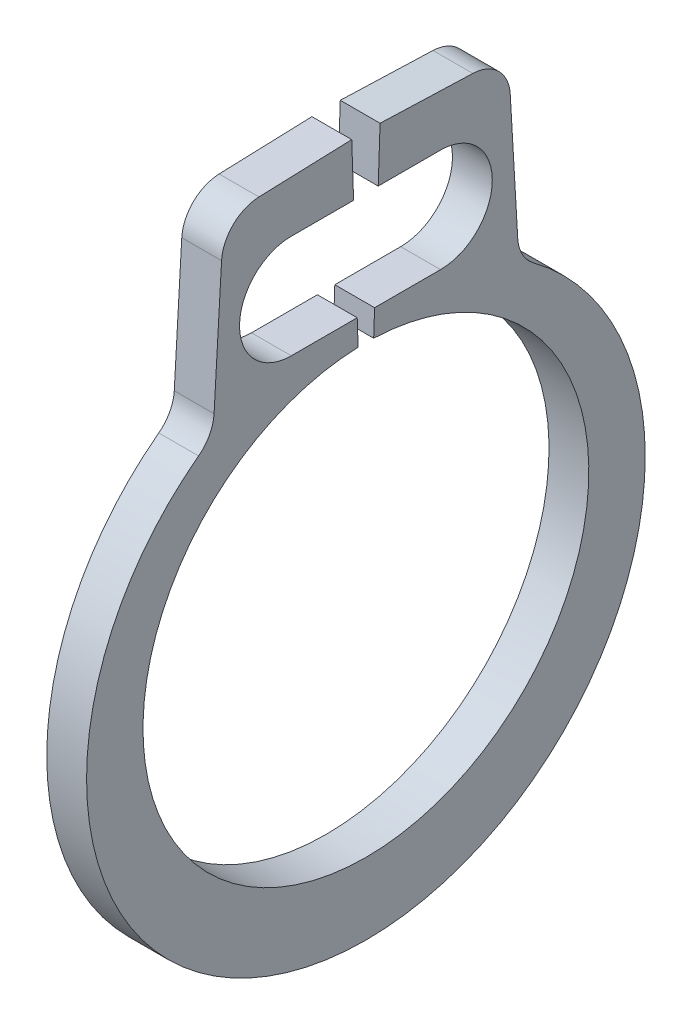
ISO-10303-21;
HEADER;
FILE_DESCRIPTION(('STEP AP214'),'2;1');
FILE_NAME('part.step','',(''),(''),'','','');
FILE_SCHEMA(('AUTOMOTIVE_DESIGN { 1 0 10303 214 1 1 1 1 }'));
ENDSEC;
DATA;
#1=APPLICATION_CONTEXT('core data for automotive mechanical design processes');
#2=APPLICATION_PROTOCOL_DEFINITION('international standard','automotive_design',2000,#1);
#3=PRODUCT_CONTEXT('',#1,'mechanical');
#4=PRODUCT('Part','Part','',(#3));
#5=PRODUCT_RELATED_PRODUCT_CATEGORY('part','',(#4));
#6=PRODUCT_DEFINITION_FORMATION('','',#4);
#7=PRODUCT_DEFINITION_CONTEXT('part definition',#1,'design');
#8=PRODUCT_DEFINITION('design','',#6,#7);
#9=PRODUCT_DEFINITION_SHAPE('','',#8);
#10=(LENGTH_UNIT() NAMED_UNIT(*) SI_UNIT(.MILLI.,.METRE.));
#11=(NAMED_UNIT(*) PLANE_ANGLE_UNIT() SI_UNIT($,.RADIAN.));
#12=(NAMED_UNIT(*) SI_UNIT($,.STERADIAN.) SOLID_ANGLE_UNIT());
#13=UNCERTAINTY_MEASURE_WITH_UNIT(LENGTH_MEASURE(1.E-05),#10,'distance_accuracy_value','');
#14=(GEOMETRIC_REPRESENTATION_CONTEXT(3) GLOBAL_UNCERTAINTY_ASSIGNED_CONTEXT((#13)) GLOBAL_UNIT_ASSIGNED_CONTEXT((#10,
#11,#12)) REPRESENTATION_CONTEXT('',''));
#15=CARTESIAN_POINT('',(0.,0.,0.));
#16=DIRECTION('',(0.,0.,1.));
#17=DIRECTION('',(1.,0.,0.));
#18=AXIS2_PLACEMENT_3D('',#15,#16,#17);
#19=CARTESIAN_POINT('',(0.127,-0.097251148319391,0.));
#20=DIRECTION('',(-1.,0.,0.));
#21=DIRECTION('',(0.,0.,1.));
#22=AXIS2_PLACEMENT_3D('',#19,#20,#21);
#23=CYLINDRICAL_SURFACE('',#22,1.78234885168061);
#24=CARTESIAN_POINT('',(-0.127,-0.097251148319391,0.));
#25=DIRECTION('',(1.,0.,0.));
#26=DIRECTION('',(0.,0.,-1.));
#27=AXIS2_PLACEMENT_3D('',#24,#25,#26);
#28=CIRCLE('',#27,1.78234885168061);
#29=CARTESIAN_POINT('',(-0.127,1.32990783380041,1.06770064570645));
#30=VERTEX_POINT('',#29);
#31=CARTESIAN_POINT('',(-0.127,1.32990783380041,-1.06770064570645));
#32=VERTEX_POINT('',#31);
#33=EDGE_CURVE('E385',#30,#32,#28,.T.);
#34=ORIENTED_EDGE('',*,*,#33,.T.);
#35=DIRECTION('',(-1.,0.,0.));
#36=VECTOR('',#35,1.);
#37=CARTESIAN_POINT('',(0.127,1.32990783380041,-1.06770064570645));
#38=LINE('',#37,#36);
#39=CARTESIAN_POINT('',(0.127,1.32990783380041,-1.06770064570645));
#40=VERTEX_POINT('',#39);
#41=EDGE_CURVE('E351',#32,#40,#38,.F.);
#42=ORIENTED_EDGE('',*,*,#41,.T.);
#43=CARTESIAN_POINT('',(0.127,-0.097251148319391,0.));
#44=DIRECTION('',(1.,0.,0.));
#45=DIRECTION('',(0.,0.,-1.));
#46=AXIS2_PLACEMENT_3D('',#43,#44,#45);
#47=CIRCLE('',#46,1.78234885168061);
#48=CARTESIAN_POINT('',(0.127,1.32990783380041,1.06770064570645));
#49=VERTEX_POINT('',#48);
#50=EDGE_CURVE('E260',#49,#40,#47,.T.);
#51=ORIENTED_EDGE('',*,*,#50,.F.);
#52=DIRECTION('',(-1.,0.,0.));
#53=VECTOR('',#52,1.);
#54=CARTESIAN_POINT('',(0.127,1.32990783380041,1.06770064570645));
#55=LINE('',#54,#53);
#56=EDGE_CURVE('E347',#49,#30,#55,.T.);
#57=ORIENTED_EDGE('',*,*,#56,.T.);
#58=EDGE_LOOP('',(#34,#42,#51,#57));
#59=FACE_BOUND('',#58,.T.);
#60=ADVANCED_FACE('F43',(#59),#23,.T.);
#61=CARTESIAN_POINT('',(0.127,2.56067815427803,-0.907799385659218));
#62=DIRECTION('',(0.,-0.0581918527693303,0.998305418332122));
#63=DIRECTION('',(0.,-0.998305418332122,-0.0581918527693303));
#64=AXIS2_PLACEMENT_3D('',#61,#62,#63);
#65=PLANE('',#64);
#66=DIRECTION('',(0.,0.998305418332122,0.0581918527693303));
#67=VECTOR('',#66,1.);
#68=CARTESIAN_POINT('',(0.127,2.56067815427803,-0.907799385659218));
#69=LINE('',#68,#67);
#70=CARTESIAN_POINT('',(0.127,1.51379445838032,-0.968822896880936));
#71=VERTEX_POINT('',#70);
#72=CARTESIAN_POINT('',(0.127,2.33546344995309,-0.920927292885706));
#73=VERTEX_POINT('',#72);
#74=EDGE_CURVE('E264',#71,#73,#69,.T.);
#75=ORIENTED_EDGE('',*,*,#74,.F.);
#76=DIRECTION('',(1.,0.,0.));
#77=VECTOR('',#76,1.);
#78=CARTESIAN_POINT('',(-0.127,1.51379445838032,-0.968822896880936));
#79=LINE('',#78,#77);
#80=CARTESIAN_POINT('',(-0.127,1.51379445838032,-0.968822896880936));
#81=VERTEX_POINT('',#80);
#82=EDGE_CURVE('E343',#71,#81,#79,.F.);
#83=ORIENTED_EDGE('',*,*,#82,.T.);
#84=DIRECTION('',(0.,0.998305418332122,0.0581918527693303));
#85=VECTOR('',#84,1.);
#86=CARTESIAN_POINT('',(-0.127,2.56067815427803,-0.907799385659218));
#87=LINE('',#86,#85);
#88=CARTESIAN_POINT('',(-0.127,2.33546344995309,-0.920927292885706));
#89=VERTEX_POINT('',#88);
#90=EDGE_CURVE('E195',#81,#89,#87,.T.);
#91=ORIENTED_EDGE('',*,*,#90,.T.);
#92=DIRECTION('',(-1.,0.,0.));
#93=VECTOR('',#92,1.);
#94=CARTESIAN_POINT('',(0.127,2.33546344995309,-0.920927292885706));
#95=LINE('',#94,#93);
#96=EDGE_CURVE('E203',#89,#73,#95,.F.);
#97=ORIENTED_EDGE('',*,*,#96,.T.);
#98=EDGE_LOOP('',(#75,#83,#91,#97));
#99=FACE_BOUND('',#98,.T.);
#100=ADVANCED_FACE('F402',(#99),#65,.F.);
#101=CARTESIAN_POINT('',(0.127,2.58922175464107,-0.0904176160568397));
#102=DIRECTION('',(0.,-0.999390827019096,0.0348994967025006));
#103=DIRECTION('',(0.,-0.0348994967025006,-0.999390827019096));
#104=AXIS2_PLACEMENT_3D('',#101,#102,#103);
#105=PLANE('',#104);
#106=DIRECTION('',(0.,0.0348994967025006,0.999390827019096));
#107=VECTOR('',#106,1.);
#108=CARTESIAN_POINT('',(0.127,2.58922175464107,-0.0904176160568397));
#109=LINE('',#108,#107);
#110=CARTESIAN_POINT('',(0.127,2.56855137592605,-0.682339816394131));
#111=VERTEX_POINT('',#110);
#112=CARTESIAN_POINT('',(0.127,2.58922175464107,-0.0904176160568397));
#113=VERTEX_POINT('',#112);
#114=EDGE_CURVE('E268',#111,#113,#109,.T.);
#115=ORIENTED_EDGE('',*,*,#114,.F.);
#116=DIRECTION('',(-1.,0.,0.));
#117=VECTOR('',#116,1.);
#118=CARTESIAN_POINT('',(0.127,2.56855137592605,-0.682339816394131));
#119=LINE('',#118,#117);
#120=CARTESIAN_POINT('',(-0.127,2.56855137592605,-0.682339816394131));
#121=VERTEX_POINT('',#120);
#122=EDGE_CURVE('E190',#111,#121,#119,.T.);
#123=ORIENTED_EDGE('',*,*,#122,.T.);
#124=DIRECTION('',(0.,0.0348994967025006,0.999390827019096));
#125=VECTOR('',#124,1.);
#126=CARTESIAN_POINT('',(-0.127,2.58922175464107,-0.0904176160568397));
#127=LINE('',#126,#125);
#128=CARTESIAN_POINT('',(-0.127,2.58922175464107,-0.0904176160568397));
#129=VERTEX_POINT('',#128);
#130=EDGE_CURVE('E183',#121,#129,#127,.T.);
#131=ORIENTED_EDGE('',*,*,#130,.T.);
#132=DIRECTION('',(-1.,0.,0.));
#133=VECTOR('',#132,1.);
#134=CARTESIAN_POINT('',(0.127,2.58922175464107,-0.0904176160568397));
#135=LINE('',#134,#133);
#136=EDGE_CURVE('E187',#113,#129,#135,.T.);
#137=ORIENTED_EDGE('',*,*,#136,.F.);
#138=EDGE_LOOP('',(#115,#123,#131,#137));
#139=FACE_BOUND('',#138,.T.);
#140=ADVANCED_FACE('F186',(#139),#105,.F.);
#141=CARTESIAN_POINT('',(0.127,2.2479,-0.0784983977404997));
#142=DIRECTION('',(0.,-0.0348994967025015,-0.999390827019096));
#143=DIRECTION('',(0.,0.999390827019096,-0.0348994967025015));
#144=AXIS2_PLACEMENT_3D('',#141,#142,#143);
#145=PLANE('',#144);
#146=ORIENTED_EDGE('',*,*,#136,.T.);
#147=DIRECTION('',(0.,-0.999390827019096,0.0348994967025015));
#148=VECTOR('',#147,1.);
#149=CARTESIAN_POINT('',(-0.127,2.2479,-0.0784983977404997));
#150=LINE('',#149,#148);
#151=CARTESIAN_POINT('',(-0.127,2.2479,-0.0784983977404997));
#152=VERTEX_POINT('',#151);
#153=EDGE_CURVE('E194',#129,#152,#150,.T.);
#154=ORIENTED_EDGE('',*,*,#153,.T.);
#155=DIRECTION('',(-1.,0.,0.));
#156=VECTOR('',#155,1.);
#157=CARTESIAN_POINT('',(0.127,2.2479,-0.0784983977404997));
#158=LINE('',#157,#156);
#159=CARTESIAN_POINT('',(0.127,2.2479,-0.0784983977404997));
#160=VERTEX_POINT('',#159);
#161=EDGE_CURVE('E204',#160,#152,#158,.T.);
#162=ORIENTED_EDGE('',*,*,#161,.F.);
#163=DIRECTION('',(0.,-0.999390827019096,0.0348994967025015));
#164=VECTOR('',#163,1.);
#165=CARTESIAN_POINT('',(0.127,2.2479,-0.0784983977404997));
#166=LINE('',#165,#164);
#167=EDGE_CURVE('E201',#113,#160,#166,.T.);
#168=ORIENTED_EDGE('',*,*,#167,.F.);
#169=EDGE_LOOP('',(#146,#154,#162,#168));
#170=FACE_BOUND('',#169,.T.);
#171=ADVANCED_FACE('F199',(#170),#145,.F.);
#172=CARTESIAN_POINT('',(0.127,2.2479,-0.0784983977404997));
#173=DIRECTION('',(0.,1.,0.));
#174=DIRECTION('',(0.,0.,1.));
#175=AXIS2_PLACEMENT_3D('',#172,#173,#174);
#176=PLANE('',#175);
#177=ORIENTED_EDGE('',*,*,#161,.T.);
#178=DIRECTION('',(0.,0.,-1.));
#179=VECTOR('',#178,1.);
#180=CARTESIAN_POINT('',(-0.127,2.2479,-0.0784983977404997));
#181=LINE('',#180,#179);
#182=CARTESIAN_POINT('',(-0.127,2.2479,-0.476156826699885));
#183=VERTEX_POINT('',#182);
#184=EDGE_CURVE('E210',#152,#183,#181,.T.);
#185=ORIENTED_EDGE('',*,*,#184,.T.);
#186=DIRECTION('',(-1.,0.,0.));
#187=VECTOR('',#186,1.);
#188=CARTESIAN_POINT('',(0.127,2.2479,-0.476156826699885));
#189=LINE('',#188,#187);
#190=CARTESIAN_POINT('',(0.127,2.2479,-0.476156826699885));
#191=VERTEX_POINT('',#190);
#192=EDGE_CURVE('E336',#191,#183,#189,.T.);
#193=ORIENTED_EDGE('',*,*,#192,.F.);
#194=DIRECTION('',(0.,0.,-1.));
#195=VECTOR('',#194,1.);
#196=CARTESIAN_POINT('',(0.127,2.2479,-0.0784983977404997));
#197=LINE('',#196,#195);
#198=EDGE_CURVE('E273',#160,#191,#197,.T.);
#199=ORIENTED_EDGE('',*,*,#198,.F.);
#200=EDGE_LOOP('',(#177,#185,#193,#199));
#201=FACE_BOUND('',#200,.T.);
#202=ADVANCED_FACE('F411',(#201),#176,.F.);
#203=CARTESIAN_POINT('',(0.127,1.9177,-0.476156826699885));
#204=DIRECTION('',(-1.,0.,0.));
#205=DIRECTION('',(0.,0.,1.));
#206=AXIS2_PLACEMENT_3D('',#203,#204,#205);
#207=CYLINDRICAL_SURFACE('',#206,0.3302);
#208=ORIENTED_EDGE('',*,*,#192,.T.);
#209=CARTESIAN_POINT('',(-0.127,1.9177,-0.476156826699885));
#210=DIRECTION('',(-1.,0.,0.));
#211=DIRECTION('',(0.,0.,-1.));
#212=AXIS2_PLACEMENT_3D('',#209,#210,#211);
#213=CIRCLE('',#212,0.3302);
#214=CARTESIAN_POINT('',(-0.127,1.5875,-0.476156826699885));
#215=VERTEX_POINT('',#214);
#216=EDGE_CURVE('E214',#183,#215,#213,.T.);
#217=ORIENTED_EDGE('',*,*,#216,.T.);
#218=DIRECTION('',(-1.,0.,0.));
#219=VECTOR('',#218,1.);
#220=CARTESIAN_POINT('',(0.127,1.5875,-0.476156826699885));
#221=LINE('',#220,#219);
#222=CARTESIAN_POINT('',(0.127,1.5875,-0.476156826699885));
#223=VERTEX_POINT('',#222);
#224=EDGE_CURVE('E333',#223,#215,#221,.T.);
#225=ORIENTED_EDGE('',*,*,#224,.F.);
#226=CARTESIAN_POINT('',(0.127,1.9177,-0.476156826699885));
#227=DIRECTION('',(-1.,0.,0.));
#228=DIRECTION('',(0.,0.,-1.));
#229=AXIS2_PLACEMENT_3D('',#226,#227,#228);
#230=CIRCLE('',#229,0.3302);
#231=EDGE_CURVE('E276',#191,#223,#230,.T.);
#232=ORIENTED_EDGE('',*,*,#231,.F.);
#233=EDGE_LOOP('',(#208,#217,#225,#232));
#234=FACE_BOUND('',#233,.T.);
#235=ADVANCED_FACE('F415',(#234),#207,.F.);
#236=CARTESIAN_POINT('',(0.127,1.5875,-0.476156826699885));
#237=DIRECTION('',(0.,-1.,0.));
#238=DIRECTION('',(0.,0.,-1.));
#239=AXIS2_PLACEMENT_3D('',#236,#237,#238);
#240=PLANE('',#239);
#241=ORIENTED_EDGE('',*,*,#224,.T.);
#242=DIRECTION('',(0.,0.,1.));
#243=VECTOR('',#242,1.);
#244=CARTESIAN_POINT('',(-0.127,1.5875,-0.476156826699885));
#245=LINE('',#244,#243);
#246=CARTESIAN_POINT('',(-0.127,1.5875,-0.0554367215681491));
#247=VERTEX_POINT('',#246);
#248=EDGE_CURVE('E221',#215,#247,#245,.T.);
#249=ORIENTED_EDGE('',*,*,#248,.T.);
#250=DIRECTION('',(-1.,0.,0.));
#251=VECTOR('',#250,1.);
#252=CARTESIAN_POINT('',(0.127,1.5875,-0.0554367215681491));
#253=LINE('',#252,#251);
#254=CARTESIAN_POINT('',(0.127,1.5875,-0.0554367215681491));
#255=VERTEX_POINT('',#254);
#256=EDGE_CURVE('E330',#255,#247,#253,.T.);
#257=ORIENTED_EDGE('',*,*,#256,.F.);
#258=DIRECTION('',(0.,0.,1.));
#259=VECTOR('',#258,1.);
#260=CARTESIAN_POINT('',(0.127,1.5875,-0.476156826699885));
#261=LINE('',#260,#259);
#262=EDGE_CURVE('E279',#223,#255,#261,.T.);
#263=ORIENTED_EDGE('',*,*,#262,.F.);
#264=EDGE_LOOP('',(#241,#249,#257,#263));
#265=FACE_BOUND('',#264,.T.);
#266=ADVANCED_FACE('F421',(#265),#240,.F.);
#267=CARTESIAN_POINT('',(0.127,1.42153351235196,-0.0496410441096369));
#268=DIRECTION('',(0.,-0.0348994967025014,-0.999390827019096));
#269=DIRECTION('',(0.,0.999390827019096,-0.0348994967025014));
#270=AXIS2_PLACEMENT_3D('',#267,#268,#269);
#271=PLANE('',#270);
#272=ORIENTED_EDGE('',*,*,#256,.T.);
#273=DIRECTION('',(0.,-0.999390827019096,0.0348994967025014));
#274=VECTOR('',#273,1.);
#275=CARTESIAN_POINT('',(-0.127,1.42153351235196,-0.0496410441096369));
#276=LINE('',#275,#274);
#277=CARTESIAN_POINT('',(-0.127,1.42153351235196,-0.0496410441096369));
#278=VERTEX_POINT('',#277);
#279=EDGE_CURVE('E225',#247,#278,#276,.T.);
#280=ORIENTED_EDGE('',*,*,#279,.T.);
#281=DIRECTION('',(-1.,0.,0.));
#282=VECTOR('',#281,1.);
#283=CARTESIAN_POINT('',(0.127,1.42153351235196,-0.0496410441096369));
#284=LINE('',#283,#282);
#285=CARTESIAN_POINT('',(0.127,1.42153351235196,-0.0496410441096369));
#286=VERTEX_POINT('',#285);
#287=EDGE_CURVE('E327',#286,#278,#284,.T.);
#288=ORIENTED_EDGE('',*,*,#287,.F.);
#289=DIRECTION('',(0.,-0.999390827019096,0.0348994967025014));
#290=VECTOR('',#289,1.);
#291=CARTESIAN_POINT('',(0.127,1.42153351235196,-0.0496410441096369));
#292=LINE('',#291,#290);
#293=EDGE_CURVE('E282',#255,#286,#292,.T.);
#294=ORIENTED_EDGE('',*,*,#293,.F.);
#295=EDGE_LOOP('',(#272,#280,#288,#294));
#296=FACE_BOUND('',#295,.T.);
#297=ADVANCED_FACE('F425',(#296),#271,.F.);
#298=CARTESIAN_POINT('',(0.127,0.,0.));
#299=DIRECTION('',(-1.,0.,0.));
#300=DIRECTION('',(0.,0.,1.));
#301=AXIS2_PLACEMENT_3D('',#298,#299,#300);
#302=CYLINDRICAL_SURFACE('',#301,1.4224);
#303=ORIENTED_EDGE('',*,*,#287,.T.);
#304=CARTESIAN_POINT('',(-0.127,0.,0.));
#305=DIRECTION('',(-1.,0.,0.));
#306=DIRECTION('',(0.,0.,-1.));
#307=AXIS2_PLACEMENT_3D('',#304,#305,#306);
#308=CIRCLE('',#307,1.4224);
#309=CARTESIAN_POINT('',(-0.127,1.42153351235196,0.0496410441096374));
#310=VERTEX_POINT('',#309);
#311=EDGE_CURVE('E229',#278,#310,#308,.T.);
#312=ORIENTED_EDGE('',*,*,#311,.T.);
#313=DIRECTION('',(-1.,0.,0.));
#314=VECTOR('',#313,1.);
#315=CARTESIAN_POINT('',(0.127,1.42153351235196,0.0496410441096374));
#316=LINE('',#315,#314);
#317=CARTESIAN_POINT('',(0.127,1.42153351235196,0.0496410441096374));
#318=VERTEX_POINT('',#317);
#319=EDGE_CURVE('E324',#318,#310,#316,.T.);
#320=ORIENTED_EDGE('',*,*,#319,.F.);
#321=CARTESIAN_POINT('',(0.127,0.,0.));
#322=DIRECTION('',(-1.,0.,0.));
#323=DIRECTION('',(0.,0.,-1.));
#324=AXIS2_PLACEMENT_3D('',#321,#322,#323);
#325=CIRCLE('',#324,1.4224);
#326=EDGE_CURVE('E285',#286,#318,#325,.T.);
#327=ORIENTED_EDGE('',*,*,#326,.F.);
#328=EDGE_LOOP('',(#303,#312,#320,#327));
#329=FACE_BOUND('',#328,.T.);
#330=ADVANCED_FACE('F430',(#329),#302,.F.);
#331=CARTESIAN_POINT('',(0.127,1.42153351235196,0.0496410441096374));
#332=DIRECTION('',(0.,-0.0348994967025012,0.999390827019096));
#333=DIRECTION('',(0.,-0.999390827019096,-0.0348994967025012));
#334=AXIS2_PLACEMENT_3D('',#331,#332,#333);
#335=PLANE('',#334);
#336=ORIENTED_EDGE('',*,*,#319,.T.);
#337=DIRECTION('',(0.,0.999390827019096,0.0348994967025012));
#338=VECTOR('',#337,1.);
#339=CARTESIAN_POINT('',(-0.127,1.42153351235196,0.0496410441096374));
#340=LINE('',#339,#338);
#341=CARTESIAN_POINT('',(-0.127,1.5875,0.0554367215681495));
#342=VERTEX_POINT('',#341);
#343=EDGE_CURVE('E233',#310,#342,#340,.T.);
#344=ORIENTED_EDGE('',*,*,#343,.T.);
#345=DIRECTION('',(-1.,0.,0.));
#346=VECTOR('',#345,1.);
#347=CARTESIAN_POINT('',(0.127,1.5875,0.0554367215681495));
#348=LINE('',#347,#346);
#349=CARTESIAN_POINT('',(0.127,1.5875,0.0554367215681495));
#350=VERTEX_POINT('',#349);
#351=EDGE_CURVE('E321',#350,#342,#348,.T.);
#352=ORIENTED_EDGE('',*,*,#351,.F.);
#353=DIRECTION('',(0.,0.999390827019096,0.0348994967025012));
#354=VECTOR('',#353,1.);
#355=CARTESIAN_POINT('',(0.127,1.42153351235196,0.0496410441096374));
#356=LINE('',#355,#354);
#357=EDGE_CURVE('E288',#318,#350,#356,.T.);
#358=ORIENTED_EDGE('',*,*,#357,.F.);
#359=EDGE_LOOP('',(#336,#344,#352,#358));
#360=FACE_BOUND('',#359,.T.);
#361=ADVANCED_FACE('F436',(#360),#335,.F.);
#362=CARTESIAN_POINT('',(0.127,1.5875,0.0554367215681495));
#363=DIRECTION('',(0.,-1.,0.));
#364=DIRECTION('',(0.,0.,-1.));
#365=AXIS2_PLACEMENT_3D('',#362,#363,#364);
#366=PLANE('',#365);
#367=ORIENTED_EDGE('',*,*,#351,.T.);
#368=DIRECTION('',(0.,0.,1.));
#369=VECTOR('',#368,1.);
#370=CARTESIAN_POINT('',(-0.127,1.5875,0.0554367215681495));
#371=LINE('',#370,#369);
#372=CARTESIAN_POINT('',(-0.127,1.5875,0.476156826699885));
#373=VERTEX_POINT('',#372);
#374=EDGE_CURVE('E237',#342,#373,#371,.T.);
#375=ORIENTED_EDGE('',*,*,#374,.T.);
#376=DIRECTION('',(-1.,0.,0.));
#377=VECTOR('',#376,1.);
#378=CARTESIAN_POINT('',(0.127,1.5875,0.476156826699885));
#379=LINE('',#378,#377);
#380=CARTESIAN_POINT('',(0.127,1.5875,0.476156826699885));
#381=VERTEX_POINT('',#380);
#382=EDGE_CURVE('E318',#381,#373,#379,.T.);
#383=ORIENTED_EDGE('',*,*,#382,.F.);
#384=DIRECTION('',(0.,0.,1.));
#385=VECTOR('',#384,1.);
#386=CARTESIAN_POINT('',(0.127,1.5875,0.0554367215681495));
#387=LINE('',#386,#385);
#388=EDGE_CURVE('E291',#350,#381,#387,.T.);
#389=ORIENTED_EDGE('',*,*,#388,.F.);
#390=EDGE_LOOP('',(#367,#375,#383,#389));
#391=FACE_BOUND('',#390,.T.);
#392=ADVANCED_FACE('F440',(#391),#366,.F.);
#393=CARTESIAN_POINT('',(0.127,1.9177,0.476156826699885));
#394=DIRECTION('',(-1.,0.,0.));
#395=DIRECTION('',(0.,0.,1.));
#396=AXIS2_PLACEMENT_3D('',#393,#394,#395);
#397=CYLINDRICAL_SURFACE('',#396,0.3302);
#398=ORIENTED_EDGE('',*,*,#382,.T.);
#399=CARTESIAN_POINT('',(-0.127,1.9177,0.476156826699885));
#400=DIRECTION('',(-1.,0.,0.));
#401=DIRECTION('',(0.,0.,-1.));
#402=AXIS2_PLACEMENT_3D('',#399,#400,#401);
#403=CIRCLE('',#402,0.3302);
#404=CARTESIAN_POINT('',(-0.127,2.2479,0.476156826699885));
#405=VERTEX_POINT('',#404);
#406=EDGE_CURVE('E241',#373,#405,#403,.T.);
#407=ORIENTED_EDGE('',*,*,#406,.T.);
#408=DIRECTION('',(-1.,0.,0.));
#409=VECTOR('',#408,1.);
#410=CARTESIAN_POINT('',(0.127,2.2479,0.476156826699885));
#411=LINE('',#410,#409);
#412=CARTESIAN_POINT('',(0.127,2.2479,0.476156826699885));
#413=VERTEX_POINT('',#412);
#414=EDGE_CURVE('E315',#413,#405,#411,.T.);
#415=ORIENTED_EDGE('',*,*,#414,.F.);
#416=CARTESIAN_POINT('',(0.127,1.9177,0.476156826699885));
#417=DIRECTION('',(-1.,0.,0.));
#418=DIRECTION('',(0.,0.,-1.));
#419=AXIS2_PLACEMENT_3D('',#416,#417,#418);
#420=CIRCLE('',#419,0.3302);
#421=EDGE_CURVE('E294',#381,#413,#420,.T.);
#422=ORIENTED_EDGE('',*,*,#421,.F.);
#423=EDGE_LOOP('',(#398,#407,#415,#422));
#424=FACE_BOUND('',#423,.T.);
#425=ADVANCED_FACE('F445',(#424),#397,.F.);
#426=CARTESIAN_POINT('',(0.127,2.2479,0.476156826699885));
#427=DIRECTION('',(0.,1.,0.));
#428=DIRECTION('',(0.,0.,1.));
#429=AXIS2_PLACEMENT_3D('',#426,#427,#428);
#430=PLANE('',#429);
#431=ORIENTED_EDGE('',*,*,#414,.T.);
#432=DIRECTION('',(0.,0.,-1.));
#433=VECTOR('',#432,1.);
#434=CARTESIAN_POINT('',(-0.127,2.2479,0.476156826699885));
#435=LINE('',#434,#433);
#436=CARTESIAN_POINT('',(-0.127,2.2479,0.0784983977404998));
#437=VERTEX_POINT('',#436);
#438=EDGE_CURVE('E245',#405,#437,#435,.T.);
#439=ORIENTED_EDGE('',*,*,#438,.T.);
#440=DIRECTION('',(-1.,0.,0.));
#441=VECTOR('',#440,1.);
#442=CARTESIAN_POINT('',(0.127,2.2479,0.0784983977404998));
#443=LINE('',#442,#441);
#444=CARTESIAN_POINT('',(0.127,2.2479,0.0784983977404998));
#445=VERTEX_POINT('',#444);
#446=EDGE_CURVE('E312',#445,#437,#443,.T.);
#447=ORIENTED_EDGE('',*,*,#446,.F.);
#448=DIRECTION('',(0.,0.,-1.));
#449=VECTOR('',#448,1.);
#450=CARTESIAN_POINT('',(0.127,2.2479,0.476156826699885));
#451=LINE('',#450,#449);
#452=EDGE_CURVE('E297',#413,#445,#451,.T.);
#453=ORIENTED_EDGE('',*,*,#452,.F.);
#454=EDGE_LOOP('',(#431,#439,#447,#453));
#455=FACE_BOUND('',#454,.T.);
#456=ADVANCED_FACE('F451',(#455),#430,.F.);
#457=CARTESIAN_POINT('',(0.127,2.2479,0.0784983977404998));
#458=DIRECTION('',(0.,-0.0348994967025011,0.999390827019096));
#459=DIRECTION('',(0.,-0.999390827019096,-0.0348994967025011));
#460=AXIS2_PLACEMENT_3D('',#457,#458,#459);
#461=PLANE('',#460);
#462=ORIENTED_EDGE('',*,*,#446,.T.);
#463=DIRECTION('',(0.,0.999390827019096,0.0348994967025011));
#464=VECTOR('',#463,1.);
#465=CARTESIAN_POINT('',(-0.127,2.2479,0.0784983977404998));
#466=LINE('',#465,#464);
#467=CARTESIAN_POINT('',(-0.127,2.58922175464107,0.0904176160568397));
#468=VERTEX_POINT('',#467);
#469=EDGE_CURVE('E249',#437,#468,#466,.T.);
#470=ORIENTED_EDGE('',*,*,#469,.T.);
#471=DIRECTION('',(-1.,0.,0.));
#472=VECTOR('',#471,1.);
#473=CARTESIAN_POINT('',(0.127,2.58922175464107,0.0904176160568397));
#474=LINE('',#473,#472);
#475=CARTESIAN_POINT('',(0.127,2.58922175464107,0.0904176160568397));
#476=VERTEX_POINT('',#475);
#477=EDGE_CURVE('E309',#476,#468,#474,.T.);
#478=ORIENTED_EDGE('',*,*,#477,.F.);
#479=DIRECTION('',(0.,0.999390827019096,0.0348994967025011));
#480=VECTOR('',#479,1.);
#481=CARTESIAN_POINT('',(0.127,2.2479,0.0784983977404998));
#482=LINE('',#481,#480);
#483=EDGE_CURVE('E300',#445,#476,#482,.T.);
#484=ORIENTED_EDGE('',*,*,#483,.F.);
#485=EDGE_LOOP('',(#462,#470,#478,#484));
#486=FACE_BOUND('',#485,.T.);
#487=ADVANCED_FACE('F455',(#486),#461,.F.);
#488=CARTESIAN_POINT('',(0.127,2.58922175464107,0.0904176160568397));
#489=DIRECTION('',(0.,-0.999390827019096,-0.0348994967025006));
#490=DIRECTION('',(0.,0.0348994967025006,-0.999390827019096));
#491=AXIS2_PLACEMENT_3D('',#488,#489,#490);
#492=PLANE('',#491);
#493=DIRECTION('',(0.,-0.0348994967025006,0.999390827019096));
#494=VECTOR('',#493,1.);
#495=CARTESIAN_POINT('',(-0.127,2.58922175464107,0.0904176160568397));
#496=LINE('',#495,#494);
#497=CARTESIAN_POINT('',(-0.127,2.56855137592605,0.682339816394131));
#498=VERTEX_POINT('',#497);
#499=EDGE_CURVE('E253',#468,#498,#496,.T.);
#500=ORIENTED_EDGE('',*,*,#499,.T.);
#501=DIRECTION('',(-1.,0.,0.));
#502=VECTOR('',#501,1.);
#503=CARTESIAN_POINT('',(0.127,2.56855137592605,0.682339816394131));
#504=LINE('',#503,#502);
#505=CARTESIAN_POINT('',(0.127,2.56855137592605,0.682339816394131));
#506=VERTEX_POINT('',#505);
#507=EDGE_CURVE('E373',#498,#506,#504,.F.);
#508=ORIENTED_EDGE('',*,*,#507,.T.);
#509=DIRECTION('',(0.,-0.0348994967025006,0.999390827019096));
#510=VECTOR('',#509,1.);
#511=CARTESIAN_POINT('',(0.127,2.58922175464107,0.0904176160568397));
#512=LINE('',#511,#510);
#513=EDGE_CURVE('E303',#476,#506,#512,.T.);
#514=ORIENTED_EDGE('',*,*,#513,.F.);
#515=ORIENTED_EDGE('',*,*,#477,.T.);
#516=EDGE_LOOP('',(#500,#508,#514,#515));
#517=FACE_BOUND('',#516,.T.);
#518=ADVANCED_FACE('F459',(#517),#492,.F.);
#519=CARTESIAN_POINT('',(0.127,2.56067815427803,0.907799385659218));
#520=DIRECTION('',(0.,-0.05819185276933,-0.998305418332122));
#521=DIRECTION('',(0.,0.998305418332122,-0.05819185276933));
#522=AXIS2_PLACEMENT_3D('',#519,#520,#521);
#523=PLANE('',#522);
#524=DIRECTION('',(0.,-0.998305418332122,0.05819185276933));
#525=VECTOR('',#524,1.);
#526=CARTESIAN_POINT('',(0.127,2.56067815427803,0.907799385659218));
#527=LINE('',#526,#525);
#528=CARTESIAN_POINT('',(0.127,2.33546344995309,0.920927292885706));
#529=VERTEX_POINT('',#528);
#530=CARTESIAN_POINT('',(0.127,1.51379445838032,0.968822896880935));
#531=VERTEX_POINT('',#530);
#532=EDGE_CURVE('E306',#529,#531,#527,.T.);
#533=ORIENTED_EDGE('',*,*,#532,.F.);
#534=DIRECTION('',(-1.,0.,0.));
#535=VECTOR('',#534,1.);
#536=CARTESIAN_POINT('',(0.127,2.33546344995309,0.920927292885706));
#537=LINE('',#536,#535);
#538=CARTESIAN_POINT('',(-0.127,2.33546344995309,0.920927292885706));
#539=VERTEX_POINT('',#538);
#540=EDGE_CURVE('E369',#529,#539,#537,.T.);
#541=ORIENTED_EDGE('',*,*,#540,.T.);
#542=DIRECTION('',(0.,-0.998305418332122,0.05819185276933));
#543=VECTOR('',#542,1.);
#544=CARTESIAN_POINT('',(-0.127,2.56067815427803,0.907799385659218));
#545=LINE('',#544,#543);
#546=CARTESIAN_POINT('',(-0.127,1.51379445838032,0.968822896880935));
#547=VERTEX_POINT('',#546);
#548=EDGE_CURVE('E257',#539,#547,#545,.T.);
#549=ORIENTED_EDGE('',*,*,#548,.T.);
#550=DIRECTION('',(1.,0.,0.));
#551=VECTOR('',#550,1.);
#552=CARTESIAN_POINT('',(0.127,1.51379445838032,0.968822896880935));
#553=LINE('',#552,#551);
#554=EDGE_CURVE('E59',#547,#531,#553,.T.);
#555=ORIENTED_EDGE('',*,*,#554,.T.);
#556=EDGE_LOOP('',(#533,#541,#549,#555));
#557=FACE_BOUND('',#556,.T.);
#558=ADVANCED_FACE('F388',(#557),#523,.F.);
#559=CARTESIAN_POINT('',(0.127,-0.097251148319391,0.));
#560=DIRECTION('',(1.,0.,0.));
#561=DIRECTION('',(0.,0.,-1.));
#562=AXIS2_PLACEMENT_3D('',#559,#560,#561);
#563=PLANE('',#562);
#564=ORIENTED_EDGE('',*,*,#74,.T.);
#565=CARTESIAN_POINT('',(0.127,2.32105223761477,-0.673696956035757));
#566=DIRECTION('',(1.,0.,0.));
#567=DIRECTION('',(0.,0.,-1.));
#568=AXIS2_PLACEMENT_3D('',#565,#566,#567);
#569=CIRCLE('',#568,0.24765);
#570=EDGE_CURVE('E364',#73,#111,#569,.T.);
#571=ORIENTED_EDGE('',*,*,#570,.T.);
#572=ORIENTED_EDGE('',*,*,#114,.T.);
#573=ORIENTED_EDGE('',*,*,#167,.T.);
#574=ORIENTED_EDGE('',*,*,#198,.T.);
#575=ORIENTED_EDGE('',*,*,#231,.T.);
#576=ORIENTED_EDGE('',*,*,#262,.T.);
#577=ORIENTED_EDGE('',*,*,#293,.T.);
#578=ORIENTED_EDGE('',*,*,#326,.T.);
#579=ORIENTED_EDGE('',*,*,#357,.T.);
#580=ORIENTED_EDGE('',*,*,#388,.T.);
#581=ORIENTED_EDGE('',*,*,#421,.T.);
#582=ORIENTED_EDGE('',*,*,#452,.T.);
#583=ORIENTED_EDGE('',*,*,#483,.T.);
#584=ORIENTED_EDGE('',*,*,#513,.T.);
#585=CARTESIAN_POINT('',(0.127,2.32105223761477,0.673696956035757));
#586=DIRECTION('',(1.,0.,0.));
#587=DIRECTION('',(0.,0.,-1.));
#588=AXIS2_PLACEMENT_3D('',#585,#586,#587);
#589=CIRCLE('',#588,0.24765);
#590=EDGE_CURVE('E66',#506,#529,#589,.T.);
#591=ORIENTED_EDGE('',*,*,#590,.T.);
#592=ORIENTED_EDGE('',*,*,#532,.T.);
#593=CARTESIAN_POINT('',(0.127,1.52820567071864,1.21605323373089));
#594=DIRECTION('',(1.,0.,0.));
#595=DIRECTION('',(0.,0.,-1.));
#596=AXIS2_PLACEMENT_3D('',#593,#594,#595);
#597=CIRCLE('',#596,0.24765);
#598=EDGE_CURVE('E11',#531,#49,#597,.F.);
#599=ORIENTED_EDGE('',*,*,#598,.T.);
#600=ORIENTED_EDGE('',*,*,#50,.T.);
#601=CARTESIAN_POINT('',(0.127,1.52820567071864,-1.21605323373089));
#602=DIRECTION('',(1.,0.,0.));
#603=DIRECTION('',(0.,0.,-1.));
#604=AXIS2_PLACEMENT_3D('',#601,#602,#603);
#605=CIRCLE('',#604,0.24765);
#606=EDGE_CURVE('E379',#40,#71,#605,.F.);
#607=ORIENTED_EDGE('',*,*,#606,.T.);
#608=EDGE_LOOP('',(#564,#571,#572,#573,#574,#575,#576,#577,#578,#579,#580,#581,#582,#583,#584,
#591,#592,#599,#600,#607));
#609=FACE_BOUND('',#608,.T.);
#610=ADVANCED_FACE('F392',(#609),#563,.T.);
#611=CARTESIAN_POINT('',(-0.127,-0.097251148319391,0.));
#612=DIRECTION('',(1.,0.,0.));
#613=DIRECTION('',(0.,0.,-1.));
#614=AXIS2_PLACEMENT_3D('',#611,#612,#613);
#615=PLANE('',#614);
#616=ORIENTED_EDGE('',*,*,#130,.F.);
#617=CARTESIAN_POINT('',(-0.127,2.32105223761477,-0.673696956035757));
#618=DIRECTION('',(1.,0.,0.));
#619=DIRECTION('',(0.,0.,-1.));
#620=AXIS2_PLACEMENT_3D('',#617,#618,#619);
#621=CIRCLE('',#620,0.24765);
#622=EDGE_CURVE('E359',#121,#89,#621,.F.);
#623=ORIENTED_EDGE('',*,*,#622,.T.);
#624=ORIENTED_EDGE('',*,*,#90,.F.);
#625=CARTESIAN_POINT('',(-0.127,1.52820567071864,-1.21605323373089));
#626=DIRECTION('',(1.,0.,0.));
#627=DIRECTION('',(0.,0.,-1.));
#628=AXIS2_PLACEMENT_3D('',#625,#626,#627);
#629=CIRCLE('',#628,0.24765);
#630=EDGE_CURVE('E376',#81,#32,#629,.T.);
#631=ORIENTED_EDGE('',*,*,#630,.T.);
#632=ORIENTED_EDGE('',*,*,#33,.F.);
#633=CARTESIAN_POINT('',(-0.127,1.52820567071864,1.21605323373089));
#634=DIRECTION('',(1.,0.,0.));
#635=DIRECTION('',(0.,0.,-1.));
#636=AXIS2_PLACEMENT_3D('',#633,#634,#635);
#637=CIRCLE('',#636,0.24765);
#638=EDGE_CURVE('E52',#30,#547,#637,.T.);
#639=ORIENTED_EDGE('',*,*,#638,.T.);
#640=ORIENTED_EDGE('',*,*,#548,.F.);
#641=CARTESIAN_POINT('',(-0.127,2.32105223761477,0.673696956035757));
#642=DIRECTION('',(1.,0.,0.));
#643=DIRECTION('',(0.,0.,-1.));
#644=AXIS2_PLACEMENT_3D('',#641,#642,#643);
#645=CIRCLE('',#644,0.24765);
#646=EDGE_CURVE('E356',#539,#498,#645,.F.);
#647=ORIENTED_EDGE('',*,*,#646,.T.);
#648=ORIENTED_EDGE('',*,*,#499,.F.);
#649=ORIENTED_EDGE('',*,*,#469,.F.);
#650=ORIENTED_EDGE('',*,*,#438,.F.);
#651=ORIENTED_EDGE('',*,*,#406,.F.);
#652=ORIENTED_EDGE('',*,*,#374,.F.);
#653=ORIENTED_EDGE('',*,*,#343,.F.);
#654=ORIENTED_EDGE('',*,*,#311,.F.);
#655=ORIENTED_EDGE('',*,*,#279,.F.);
#656=ORIENTED_EDGE('',*,*,#248,.F.);
#657=ORIENTED_EDGE('',*,*,#216,.F.);
#658=ORIENTED_EDGE('',*,*,#184,.F.);
#659=ORIENTED_EDGE('',*,*,#153,.F.);
#660=EDGE_LOOP('',(#616,#623,#624,#631,#632,#639,#640,#647,#648,#649,#650,#651,#652,#653,#654,
#655,#656,#657,#658,#659));
#661=FACE_BOUND('',#660,.T.);
#662=ADVANCED_FACE('F207',(#661),#615,.F.);
#663=CARTESIAN_POINT('',(0.127,1.52820567071864,-1.21605323373089));
#664=DIRECTION('',(-1.,0.,0.));
#665=DIRECTION('',(0.,0.,1.));
#666=AXIS2_PLACEMENT_3D('',#663,#664,#665);
#667=CYLINDRICAL_SURFACE('',#666,0.24765);
#668=ORIENTED_EDGE('',*,*,#606,.F.);
#669=ORIENTED_EDGE('',*,*,#41,.F.);
#670=ORIENTED_EDGE('',*,*,#630,.F.);
#671=ORIENTED_EDGE('',*,*,#82,.F.);
#672=EDGE_LOOP('',(#668,#669,#670,#671));
#673=FACE_BOUND('',#672,.T.);
#674=ADVANCED_FACE('F397',(#673),#667,.F.);
#675=CARTESIAN_POINT('',(0.127,2.32105223761477,-0.673696956035757));
#676=DIRECTION('',(-1.,0.,0.));
#677=DIRECTION('',(0.,0.,1.));
#678=AXIS2_PLACEMENT_3D('',#675,#676,#677);
#679=CYLINDRICAL_SURFACE('',#678,0.24765);
#680=ORIENTED_EDGE('',*,*,#570,.F.);
#681=ORIENTED_EDGE('',*,*,#96,.F.);
#682=ORIENTED_EDGE('',*,*,#622,.F.);
#683=ORIENTED_EDGE('',*,*,#122,.F.);
#684=EDGE_LOOP('',(#680,#681,#682,#683));
#685=FACE_BOUND('',#684,.T.);
#686=ADVANCED_FACE('F407',(#685),#679,.T.);
#687=CARTESIAN_POINT('',(0.127,2.32105223761477,0.673696956035757));
#688=DIRECTION('',(-1.,0.,0.));
#689=DIRECTION('',(0.,0.,1.));
#690=AXIS2_PLACEMENT_3D('',#687,#688,#689);
#691=CYLINDRICAL_SURFACE('',#690,0.24765);
#692=ORIENTED_EDGE('',*,*,#590,.F.);
#693=ORIENTED_EDGE('',*,*,#507,.F.);
#694=ORIENTED_EDGE('',*,*,#646,.F.);
#695=ORIENTED_EDGE('',*,*,#540,.F.);
#696=EDGE_LOOP('',(#692,#693,#694,#695));
#697=FACE_BOUND('',#696,.T.);
#698=ADVANCED_FACE('F462',(#697),#691,.T.);
#699=CARTESIAN_POINT('',(0.127,1.52820567071864,1.21605323373089));
#700=DIRECTION('',(-1.,0.,0.));
#701=DIRECTION('',(0.,0.,1.));
#702=AXIS2_PLACEMENT_3D('',#699,#700,#701);
#703=CYLINDRICAL_SURFACE('',#702,0.24765);
#704=ORIENTED_EDGE('',*,*,#598,.F.);
#705=ORIENTED_EDGE('',*,*,#554,.F.);
#706=ORIENTED_EDGE('',*,*,#638,.F.);
#707=ORIENTED_EDGE('',*,*,#56,.F.);
#708=EDGE_LOOP('',(#704,#705,#706,#707));
#709=FACE_BOUND('',#708,.T.);
#710=ADVANCED_FACE('F45',(#709),#703,.F.);
#711=CLOSED_SHELL('',(#60,#100,#140,#171,#202,#235,#266,#297,#330,#361,#392,#425,#456,#487,#518,
#558,#610,#662,#674,#686,#698,#710));
#712=MANIFOLD_SOLID_BREP('B2',#711);
#713=ADVANCED_BREP_SHAPE_REPRESENTATION('',(#18,#712),#14);
#714=SHAPE_DEFINITION_REPRESENTATION(#9,#713);
ENDSEC;
END-ISO-10303-21;
